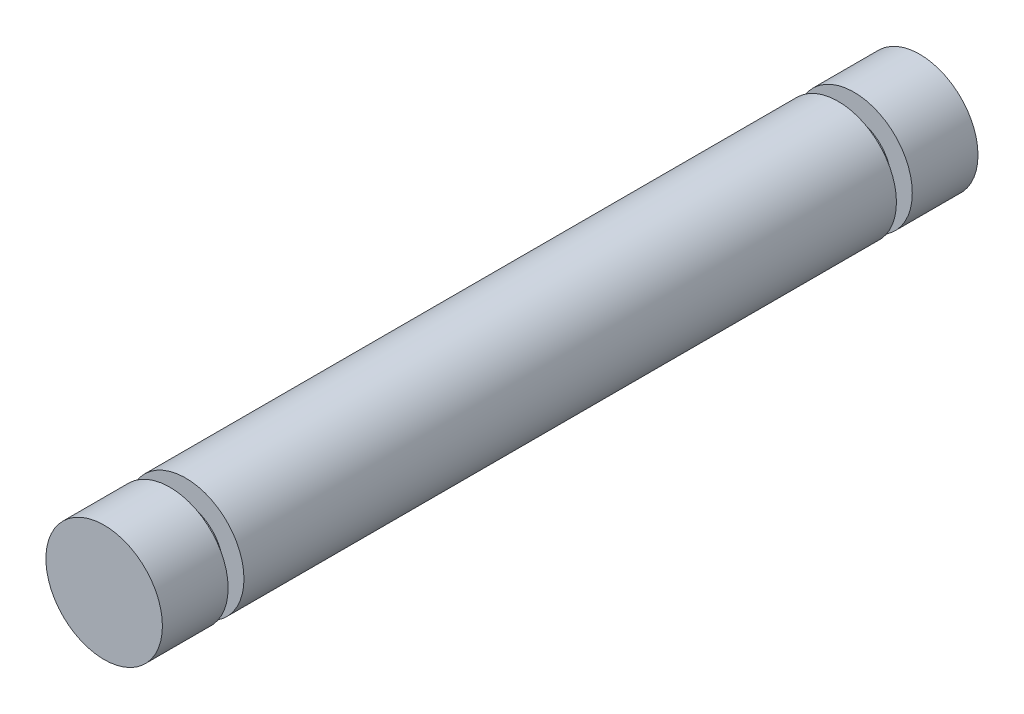
ISO-10303-21;
HEADER;
FILE_DESCRIPTION(('STEP AP214'),'2;1');
FILE_NAME('part.step','',(''),(''),'','','');
FILE_SCHEMA(('AUTOMOTIVE_DESIGN { 1 0 10303 214 1 1 1 1 }'));
ENDSEC;
DATA;
#1=APPLICATION_CONTEXT('core data for automotive mechanical design processes');
#2=APPLICATION_PROTOCOL_DEFINITION('international standard','automotive_design',2000,#1);
#3=PRODUCT_CONTEXT('',#1,'mechanical');
#4=PRODUCT('Part','Part','',(#3));
#5=PRODUCT_RELATED_PRODUCT_CATEGORY('part','',(#4));
#6=PRODUCT_DEFINITION_FORMATION('','',#4);
#7=PRODUCT_DEFINITION_CONTEXT('part definition',#1,'design');
#8=PRODUCT_DEFINITION('design','',#6,#7);
#9=PRODUCT_DEFINITION_SHAPE('','',#8);
#10=(LENGTH_UNIT() NAMED_UNIT(*) SI_UNIT(.MILLI.,.METRE.));
#11=(NAMED_UNIT(*) PLANE_ANGLE_UNIT() SI_UNIT($,.RADIAN.));
#12=(NAMED_UNIT(*) SI_UNIT($,.STERADIAN.) SOLID_ANGLE_UNIT());
#13=UNCERTAINTY_MEASURE_WITH_UNIT(LENGTH_MEASURE(1.E-05),#10,'distance_accuracy_value','');
#14=(GEOMETRIC_REPRESENTATION_CONTEXT(3) GLOBAL_UNCERTAINTY_ASSIGNED_CONTEXT((#13)) GLOBAL_UNIT_ASSIGNED_CONTEXT((#10,
#11,#12)) REPRESENTATION_CONTEXT('',''));
#15=CARTESIAN_POINT('',(0.,0.,0.));
#16=DIRECTION('',(0.,0.,1.));
#17=DIRECTION('',(1.,0.,0.));
#18=AXIS2_PLACEMENT_3D('',#15,#16,#17);
#19=CARTESIAN_POINT('',(0.,0.,35.));
#20=DIRECTION('',(0.,0.,-1.));
#21=DIRECTION('',(-1.,0.,0.));
#22=AXIS2_PLACEMENT_3D('',#19,#20,#21);
#23=CYLINDRICAL_SURFACE('',#22,2.5);
#24=CARTESIAN_POINT('',(0.,0.,35.));
#25=DIRECTION('',(0.,0.,1.));
#26=DIRECTION('',(1.,0.,0.));
#27=AXIS2_PLACEMENT_3D('',#24,#25,#26);
#28=CIRCLE('',#27,2.5);
#29=CARTESIAN_POINT('',(2.5,0.,35.));
#30=VERTEX_POINT('',#29);
#31=EDGE_CURVE('E10',#30,#30,#28,.T.);
#32=ORIENTED_EDGE('',*,*,#31,.F.);
#33=EDGE_LOOP('',(#32));
#34=FACE_BOUND('',#33,.T.);
#35=CARTESIAN_POINT('',(0.,0.,32.18));
#36=DIRECTION('',(0.,0.,1.));
#37=DIRECTION('',(1.,0.,0.));
#38=AXIS2_PLACEMENT_3D('',#35,#36,#37);
#39=CIRCLE('',#38,2.5);
#40=CARTESIAN_POINT('',(2.5,0.,32.18));
#41=VERTEX_POINT('',#40);
#42=EDGE_CURVE('E48',#41,#41,#39,.T.);
#43=ORIENTED_EDGE('',*,*,#42,.T.);
#44=EDGE_LOOP('',(#43));
#45=FACE_BOUND('',#44,.T.);
#46=ADVANCED_FACE('F36',(#34,#45),#23,.T.);
#47=CARTESIAN_POINT('',(0.,0.,35.));
#48=DIRECTION('',(0.,0.,1.));
#49=DIRECTION('',(1.,0.,0.));
#50=AXIS2_PLACEMENT_3D('',#47,#48,#49);
#51=PLANE('',#50);
#52=ORIENTED_EDGE('',*,*,#31,.T.);
#53=EDGE_LOOP('',(#52));
#54=FACE_BOUND('',#53,.T.);
#55=ADVANCED_FACE('F105',(#54),#51,.T.);
#56=CARTESIAN_POINT('',(0.,2.5,32.18));
#57=DIRECTION('',(0.,0.,-1.));
#58=DIRECTION('',(-1.,0.,0.));
#59=AXIS2_PLACEMENT_3D('',#56,#57,#58);
#60=PLANE('',#59);
#61=CARTESIAN_POINT('',(0.,0.,32.18));
#62=DIRECTION('',(0.,0.,1.));
#63=DIRECTION('',(1.,0.,0.));
#64=AXIS2_PLACEMENT_3D('',#61,#62,#63);
#65=CIRCLE('',#64,1.6);
#66=CARTESIAN_POINT('',(1.6,0.,32.18));
#67=VERTEX_POINT('',#66);
#68=EDGE_CURVE('E70',#67,#67,#65,.T.);
#69=ORIENTED_EDGE('',*,*,#68,.T.);
#70=EDGE_LOOP('',(#69));
#71=FACE_BOUND('',#70,.T.);
#72=ORIENTED_EDGE('',*,*,#42,.F.);
#73=EDGE_LOOP('',(#72));
#74=FACE_BOUND('',#73,.T.);
#75=ADVANCED_FACE('F112',(#71,#74),#60,.T.);
#76=CARTESIAN_POINT('',(0.,0.,35.));
#77=DIRECTION('',(0.,0.,1.));
#78=DIRECTION('',(1.,0.,0.));
#79=AXIS2_PLACEMENT_3D('',#76,#77,#78);
#80=CYLINDRICAL_SURFACE('',#79,1.6);
#81=CARTESIAN_POINT('',(0.,0.,31.5));
#82=DIRECTION('',(0.,0.,1.));
#83=DIRECTION('',(1.,0.,0.));
#84=AXIS2_PLACEMENT_3D('',#81,#82,#83);
#85=CIRCLE('',#84,1.6);
#86=CARTESIAN_POINT('',(1.6,0.,31.5));
#87=VERTEX_POINT('',#86);
#88=EDGE_CURVE('E74',#87,#87,#85,.T.);
#89=ORIENTED_EDGE('',*,*,#88,.T.);
#90=EDGE_LOOP('',(#89));
#91=FACE_BOUND('',#90,.T.);
#92=ORIENTED_EDGE('',*,*,#68,.F.);
#93=EDGE_LOOP('',(#92));
#94=FACE_BOUND('',#93,.T.);
#95=ADVANCED_FACE('F99',(#91,#94),#80,.T.);
#96=CARTESIAN_POINT('',(0.,1.6,31.5));
#97=DIRECTION('',(0.,0.,1.));
#98=DIRECTION('',(1.,0.,0.));
#99=AXIS2_PLACEMENT_3D('',#96,#97,#98);
#100=PLANE('',#99);
#101=CARTESIAN_POINT('',(0.,0.,31.5));
#102=DIRECTION('',(0.,0.,1.));
#103=DIRECTION('',(1.,0.,0.));
#104=AXIS2_PLACEMENT_3D('',#101,#102,#103);
#105=CIRCLE('',#104,2.5);
#106=CARTESIAN_POINT('',(2.5,0.,31.5));
#107=VERTEX_POINT('',#106);
#108=EDGE_CURVE('E54',#107,#107,#105,.T.);
#109=ORIENTED_EDGE('',*,*,#108,.T.);
#110=EDGE_LOOP('',(#109));
#111=FACE_BOUND('',#110,.T.);
#112=ORIENTED_EDGE('',*,*,#88,.F.);
#113=EDGE_LOOP('',(#112));
#114=FACE_BOUND('',#113,.T.);
#115=ADVANCED_FACE('F82',(#111,#114),#100,.T.);
#116=CARTESIAN_POINT('',(0.,0.,3.5));
#117=DIRECTION('',(0.,0.,1.));
#118=DIRECTION('',(1.,0.,0.));
#119=AXIS2_PLACEMENT_3D('',#116,#117,#118);
#120=CIRCLE('',#119,2.5);
#121=CARTESIAN_POINT('',(2.5,0.,3.5));
#122=VERTEX_POINT('',#121);
#123=EDGE_CURVE('E59',#122,#122,#120,.T.);
#124=ORIENTED_EDGE('',*,*,#123,.T.);
#125=EDGE_LOOP('',(#124));
#126=FACE_BOUND('',#125,.T.);
#127=ORIENTED_EDGE('',*,*,#108,.F.);
#128=EDGE_LOOP('',(#127));
#129=FACE_BOUND('',#128,.T.);
#130=ADVANCED_FACE('F85',(#126,#129),#23,.T.);
#131=CARTESIAN_POINT('',(0.,2.5,2.82));
#132=DIRECTION('',(0.,0.,1.));
#133=DIRECTION('',(1.,0.,0.));
#134=AXIS2_PLACEMENT_3D('',#131,#132,#133);
#135=PLANE('',#134);
#136=CARTESIAN_POINT('',(0.,0.,2.82));
#137=DIRECTION('',(0.,0.,1.));
#138=DIRECTION('',(1.,0.,0.));
#139=AXIS2_PLACEMENT_3D('',#136,#137,#138);
#140=CIRCLE('',#139,2.5);
#141=CARTESIAN_POINT('',(2.5,0.,2.82));
#142=VERTEX_POINT('',#141);
#143=EDGE_CURVE('E63',#142,#142,#140,.T.);
#144=ORIENTED_EDGE('',*,*,#143,.T.);
#145=EDGE_LOOP('',(#144));
#146=FACE_BOUND('',#145,.T.);
#147=CARTESIAN_POINT('',(0.,0.,2.82));
#148=DIRECTION('',(0.,0.,1.));
#149=DIRECTION('',(1.,0.,0.));
#150=AXIS2_PLACEMENT_3D('',#147,#148,#149);
#151=CIRCLE('',#150,1.6);
#152=CARTESIAN_POINT('',(1.6,0.,2.82));
#153=VERTEX_POINT('',#152);
#154=EDGE_CURVE('E50',#153,#153,#151,.T.);
#155=ORIENTED_EDGE('',*,*,#154,.F.);
#156=EDGE_LOOP('',(#155));
#157=FACE_BOUND('',#156,.T.);
#158=ADVANCED_FACE('F87',(#146,#157),#135,.T.);
#159=CARTESIAN_POINT('',(0.,0.,35.));
#160=DIRECTION('',(0.,0.,1.));
#161=DIRECTION('',(1.,0.,0.));
#162=AXIS2_PLACEMENT_3D('',#159,#160,#161);
#163=CYLINDRICAL_SURFACE('',#162,1.6);
#164=ORIENTED_EDGE('',*,*,#154,.T.);
#165=EDGE_LOOP('',(#164));
#166=FACE_BOUND('',#165,.T.);
#167=CARTESIAN_POINT('',(0.,0.,3.5));
#168=DIRECTION('',(0.,0.,1.));
#169=DIRECTION('',(1.,0.,0.));
#170=AXIS2_PLACEMENT_3D('',#167,#168,#169);
#171=CIRCLE('',#170,1.6);
#172=CARTESIAN_POINT('',(1.6,0.,3.5));
#173=VERTEX_POINT('',#172);
#174=EDGE_CURVE('E55',#173,#173,#171,.T.);
#175=ORIENTED_EDGE('',*,*,#174,.F.);
#176=EDGE_LOOP('',(#175));
#177=FACE_BOUND('',#176,.T.);
#178=ADVANCED_FACE('F95',(#166,#177),#163,.T.);
#179=CARTESIAN_POINT('',(0.,1.6,3.5));
#180=DIRECTION('',(0.,0.,-1.));
#181=DIRECTION('',(-1.,0.,0.));
#182=AXIS2_PLACEMENT_3D('',#179,#180,#181);
#183=PLANE('',#182);
#184=ORIENTED_EDGE('',*,*,#174,.T.);
#185=EDGE_LOOP('',(#184));
#186=FACE_BOUND('',#185,.T.);
#187=ORIENTED_EDGE('',*,*,#123,.F.);
#188=EDGE_LOOP('',(#187));
#189=FACE_BOUND('',#188,.T.);
#190=ADVANCED_FACE('F125',(#186,#189),#183,.T.);
#191=CARTESIAN_POINT('',(0.,0.,0.));
#192=DIRECTION('',(0.,0.,1.));
#193=DIRECTION('',(1.,0.,0.));
#194=AXIS2_PLACEMENT_3D('',#191,#192,#193);
#195=PLANE('',#194);
#196=CARTESIAN_POINT('',(0.,0.,0.));
#197=DIRECTION('',(0.,0.,1.));
#198=DIRECTION('',(1.,0.,0.));
#199=AXIS2_PLACEMENT_3D('',#196,#197,#198);
#200=CIRCLE('',#199,2.5);
#201=CARTESIAN_POINT('',(2.5,0.,0.));
#202=VERTEX_POINT('',#201);
#203=EDGE_CURVE('E39',#202,#202,#200,.T.);
#204=ORIENTED_EDGE('',*,*,#203,.F.);
#205=EDGE_LOOP('',(#204));
#206=FACE_BOUND('',#205,.T.);
#207=ADVANCED_FACE('F102',(#206),#195,.F.);
#208=ORIENTED_EDGE('',*,*,#203,.T.);
#209=EDGE_LOOP('',(#208));
#210=FACE_BOUND('',#209,.T.);
#211=ORIENTED_EDGE('',*,*,#143,.F.);
#212=EDGE_LOOP('',(#211));
#213=FACE_BOUND('',#212,.T.);
#214=ADVANCED_FACE('F89',(#210,#213),#23,.T.);
#215=CLOSED_SHELL('',(#46,#55,#75,#95,#115,#130,#158,#178,#190,#207,#214));
#216=MANIFOLD_SOLID_BREP('B2',#215);
#217=ADVANCED_BREP_SHAPE_REPRESENTATION('',(#18,#216),#14);
#218=SHAPE_DEFINITION_REPRESENTATION(#9,#217);
ENDSEC;
END-ISO-10303-21;
